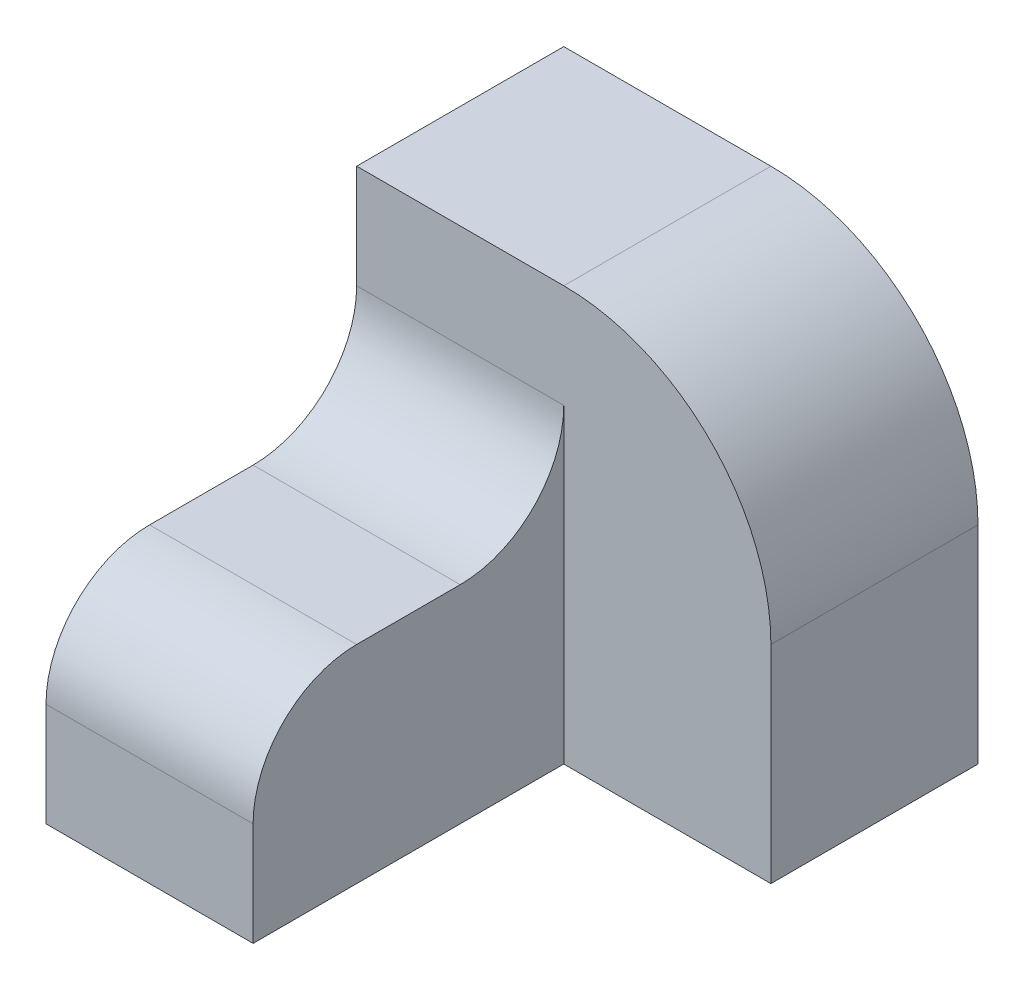
ISO-10303-21;
HEADER;
FILE_DESCRIPTION(('STEP AP214'),'2;1');
FILE_NAME('part.step','',(''),(''),'','','');
FILE_SCHEMA(('AUTOMOTIVE_DESIGN { 1 0 10303 214 1 1 1 1 }'));
ENDSEC;
DATA;
#1=APPLICATION_CONTEXT('core data for automotive mechanical design processes');
#2=APPLICATION_PROTOCOL_DEFINITION('international standard','automotive_design',2000,#1);
#3=PRODUCT_CONTEXT('',#1,'mechanical');
#4=PRODUCT('Part','Part','',(#3));
#5=PRODUCT_RELATED_PRODUCT_CATEGORY('part','',(#4));
#6=PRODUCT_DEFINITION_FORMATION('','',#4);
#7=PRODUCT_DEFINITION_CONTEXT('part definition',#1,'design');
#8=PRODUCT_DEFINITION('design','',#6,#7);
#9=PRODUCT_DEFINITION_SHAPE('','',#8);
#10=(LENGTH_UNIT() NAMED_UNIT(*) SI_UNIT(.MILLI.,.METRE.));
#11=(NAMED_UNIT(*) PLANE_ANGLE_UNIT() SI_UNIT($,.RADIAN.));
#12=(NAMED_UNIT(*) SI_UNIT($,.STERADIAN.) SOLID_ANGLE_UNIT());
#13=UNCERTAINTY_MEASURE_WITH_UNIT(LENGTH_MEASURE(1.E-05),#10,'distance_accuracy_value','');
#14=(GEOMETRIC_REPRESENTATION_CONTEXT(3) GLOBAL_UNCERTAINTY_ASSIGNED_CONTEXT((#13)) GLOBAL_UNIT_ASSIGNED_CONTEXT((#10,
#11,#12)) REPRESENTATION_CONTEXT('',''));
#15=CARTESIAN_POINT('',(0.,0.,0.));
#16=DIRECTION('',(0.,0.,1.));
#17=DIRECTION('',(1.,0.,0.));
#18=AXIS2_PLACEMENT_3D('',#15,#16,#17);
#19=CARTESIAN_POINT('',(8.61252963227666,8.63066834896516,-1.26566204034582));
#20=DIRECTION('',(1.,0.,0.));
#21=DIRECTION('',(0.,0.,-1.));
#22=AXIS2_PLACEMENT_3D('',#19,#20,#21);
#23=PLANE('',#22);
#24=DIRECTION('',(0.,0.,1.));
#25=VECTOR('',#24,1.);
#26=CARTESIAN_POINT('',(8.61252963227666,8.63066834896516,-1.26566204034582));
#27=LINE('',#26,#25);
#28=CARTESIAN_POINT('',(8.61252963227666,8.63066834896516,-0.265662040345824));
#29=VERTEX_POINT('',#28);
#30=CARTESIAN_POINT('',(8.61252963227666,8.63066834896516,0.734337959654176));
#31=VERTEX_POINT('',#30);
#32=EDGE_CURVE('E153',#29,#31,#27,.T.);
#33=ORIENTED_EDGE('',*,*,#32,.T.);
#34=CARTESIAN_POINT('',(8.61252963227666,7.63066834896515,0.734337959654176));
#35=DIRECTION('',(1.,0.,0.));
#36=DIRECTION('',(0.,0.,-1.));
#37=AXIS2_PLACEMENT_3D('',#34,#35,#36);
#38=CIRCLE('',#37,1.);
#39=CARTESIAN_POINT('',(8.61252963227666,7.63066834896515,1.73433795965418));
#40=VERTEX_POINT('',#39);
#41=EDGE_CURVE('E181',#31,#40,#38,.T.);
#42=ORIENTED_EDGE('',*,*,#41,.T.);
#43=DIRECTION('',(0.,-1.,0.));
#44=VECTOR('',#43,1.);
#45=CARTESIAN_POINT('',(8.61252963227666,8.63066834896516,1.73433795965418));
#46=LINE('',#45,#44);
#47=CARTESIAN_POINT('',(8.61252963227666,6.63066834896515,1.73433795965418));
#48=VERTEX_POINT('',#47);
#49=EDGE_CURVE('E160',#40,#48,#46,.T.);
#50=ORIENTED_EDGE('',*,*,#49,.T.);
#51=DIRECTION('',(0.,0.,1.));
#52=VECTOR('',#51,1.);
#53=CARTESIAN_POINT('',(8.61252963227666,6.63066834896515,-1.26566204034582));
#54=LINE('',#53,#52);
#55=CARTESIAN_POINT('',(8.61252963227666,6.63066834896515,-1.26566204034582));
#56=VERTEX_POINT('',#55);
#57=EDGE_CURVE('E152',#56,#48,#54,.T.);
#58=ORIENTED_EDGE('',*,*,#57,.F.);
#59=DIRECTION('',(0.,-1.,0.));
#60=VECTOR('',#59,1.);
#61=CARTESIAN_POINT('',(8.61252963227666,8.63066834896516,-1.26566204034582));
#62=LINE('',#61,#60);
#63=CARTESIAN_POINT('',(8.61252963227666,9.63066834896516,-1.26566204034582));
#64=VERTEX_POINT('',#63);
#65=EDGE_CURVE('E170',#64,#56,#62,.T.);
#66=ORIENTED_EDGE('',*,*,#65,.F.);
#67=CARTESIAN_POINT('',(8.61252963227666,9.63066834896516,-0.265662040345824));
#68=DIRECTION('',(1.,0.,0.));
#69=DIRECTION('',(0.,0.,-1.));
#70=AXIS2_PLACEMENT_3D('',#67,#68,#69);
#71=CIRCLE('',#70,1.);
#72=EDGE_CURVE('E187',#64,#29,#71,.F.);
#73=ORIENTED_EDGE('',*,*,#72,.T.);
#74=EDGE_LOOP('',(#33,#42,#50,#58,#66,#73));
#75=FACE_BOUND('',#74,.T.);
#76=ADVANCED_FACE('F38',(#75),#23,.T.);
#77=CARTESIAN_POINT('',(6.61252963227666,8.63066834896516,-1.26566204034582));
#78=DIRECTION('',(1.,0.,0.));
#79=DIRECTION('',(0.,0.,-1.));
#80=AXIS2_PLACEMENT_3D('',#77,#78,#79);
#81=PLANE('',#80);
#82=DIRECTION('',(0.,-1.,0.));
#83=VECTOR('',#82,1.);
#84=CARTESIAN_POINT('',(6.61252963227666,8.63066834896516,1.73433795965418));
#85=LINE('',#84,#83);
#86=CARTESIAN_POINT('',(6.61252963227666,7.63066834896515,1.73433795965418));
#87=VERTEX_POINT('',#86);
#88=CARTESIAN_POINT('',(6.61252963227666,6.63066834896515,1.73433795965418));
#89=VERTEX_POINT('',#88);
#90=EDGE_CURVE('E168',#87,#89,#85,.T.);
#91=ORIENTED_EDGE('',*,*,#90,.F.);
#92=CARTESIAN_POINT('',(6.61252963227666,7.63066834896515,0.734337959654176));
#93=DIRECTION('',(1.,0.,0.));
#94=DIRECTION('',(0.,0.,-1.));
#95=AXIS2_PLACEMENT_3D('',#92,#93,#94);
#96=CIRCLE('',#95,1.);
#97=CARTESIAN_POINT('',(6.61252963227666,8.63066834896516,0.734337959654176));
#98=VERTEX_POINT('',#97);
#99=EDGE_CURVE('E185',#87,#98,#96,.F.);
#100=ORIENTED_EDGE('',*,*,#99,.T.);
#101=DIRECTION('',(0.,0.,1.));
#102=VECTOR('',#101,1.);
#103=CARTESIAN_POINT('',(6.61252963227666,8.63066834896516,-1.26566204034582));
#104=LINE('',#103,#102);
#105=CARTESIAN_POINT('',(6.61252963227666,8.63066834896516,-0.265662040345824));
#106=VERTEX_POINT('',#105);
#107=EDGE_CURVE('E156',#106,#98,#104,.T.);
#108=ORIENTED_EDGE('',*,*,#107,.F.);
#109=CARTESIAN_POINT('',(6.61252963227666,9.63066834896516,-0.265662040345824));
#110=DIRECTION('',(1.,0.,0.));
#111=DIRECTION('',(0.,0.,-1.));
#112=AXIS2_PLACEMENT_3D('',#109,#110,#111);
#113=CIRCLE('',#112,1.);
#114=CARTESIAN_POINT('',(6.61252963227666,9.63066834896516,-1.26566204034582));
#115=VERTEX_POINT('',#114);
#116=EDGE_CURVE('E189',#106,#115,#113,.T.);
#117=ORIENTED_EDGE('',*,*,#116,.T.);
#118=DIRECTION('',(0.,-1.,0.));
#119=VECTOR('',#118,1.);
#120=CARTESIAN_POINT('',(6.61252963227666,10.6306683489652,-1.26566204034582));
#121=LINE('',#120,#119);
#122=CARTESIAN_POINT('',(6.61252963227666,10.6306683489652,-1.26566204034582));
#123=VERTEX_POINT('',#122);
#124=EDGE_CURVE('E122',#123,#115,#121,.T.);
#125=ORIENTED_EDGE('',*,*,#124,.F.);
#126=DIRECTION('',(0.,0.,-1.));
#127=VECTOR('',#126,1.);
#128=CARTESIAN_POINT('',(6.61252963227666,10.6306683489652,-1.26566204034582));
#129=LINE('',#128,#127);
#130=CARTESIAN_POINT('',(6.61252963227666,10.6306683489652,-3.26566204034582));
#131=VERTEX_POINT('',#130);
#132=EDGE_CURVE('E129',#123,#131,#129,.T.);
#133=ORIENTED_EDGE('',*,*,#132,.T.);
#134=DIRECTION('',(0.,-1.,0.));
#135=VECTOR('',#134,1.);
#136=CARTESIAN_POINT('',(6.61252963227666,10.6306683489652,-3.26566204034582));
#137=LINE('',#136,#135);
#138=CARTESIAN_POINT('',(6.61252963227666,6.63066834896515,-3.26566204034582));
#139=VERTEX_POINT('',#138);
#140=EDGE_CURVE('E112',#131,#139,#137,.T.);
#141=ORIENTED_EDGE('',*,*,#140,.T.);
#142=DIRECTION('',(0.,0.,1.));
#143=VECTOR('',#142,1.);
#144=CARTESIAN_POINT('',(6.61252963227666,6.63066834896515,-1.26566204034582));
#145=LINE('',#144,#143);
#146=EDGE_CURVE('E163',#139,#89,#145,.T.);
#147=ORIENTED_EDGE('',*,*,#146,.T.);
#148=EDGE_LOOP('',(#91,#100,#108,#117,#125,#133,#141,#147));
#149=FACE_BOUND('',#148,.T.);
#150=ADVANCED_FACE('F135',(#149),#81,.F.);
#151=CARTESIAN_POINT('',(6.61252963227666,8.63066834896516,1.73433795965418));
#152=DIRECTION('',(0.,0.,-1.));
#153=DIRECTION('',(-1.,0.,0.));
#154=AXIS2_PLACEMENT_3D('',#151,#152,#153);
#155=PLANE('',#154);
#156=ORIENTED_EDGE('',*,*,#49,.F.);
#157=DIRECTION('',(1.,0.,0.));
#158=VECTOR('',#157,1.);
#159=CARTESIAN_POINT('',(6.61252963227666,7.63066834896515,1.73433795965418));
#160=LINE('',#159,#158);
#161=EDGE_CURVE('E183',#40,#87,#160,.F.);
#162=ORIENTED_EDGE('',*,*,#161,.T.);
#163=ORIENTED_EDGE('',*,*,#90,.T.);
#164=DIRECTION('',(1.,0.,0.));
#165=VECTOR('',#164,1.);
#166=CARTESIAN_POINT('',(6.61252963227666,6.63066834896515,1.73433795965418));
#167=LINE('',#166,#165);
#168=EDGE_CURVE('E157',#89,#48,#167,.T.);
#169=ORIENTED_EDGE('',*,*,#168,.T.);
#170=EDGE_LOOP('',(#156,#162,#163,#169));
#171=FACE_BOUND('',#170,.T.);
#172=ADVANCED_FACE('F212',(#171),#155,.F.);
#173=CARTESIAN_POINT('',(6.61252963227666,8.63066834896516,-1.26566204034582));
#174=DIRECTION('',(0.,1.,0.));
#175=DIRECTION('',(0.,0.,1.));
#176=AXIS2_PLACEMENT_3D('',#173,#174,#175);
#177=PLANE('',#176);
#178=ORIENTED_EDGE('',*,*,#32,.F.);
#179=DIRECTION('',(1.,0.,0.));
#180=VECTOR('',#179,1.);
#181=CARTESIAN_POINT('',(6.61252963227666,8.63066834896516,-0.265662040345824));
#182=LINE('',#181,#180);
#183=EDGE_CURVE('E179',#29,#106,#182,.F.);
#184=ORIENTED_EDGE('',*,*,#183,.T.);
#185=ORIENTED_EDGE('',*,*,#107,.T.);
#186=DIRECTION('',(1.,0.,0.));
#187=VECTOR('',#186,1.);
#188=CARTESIAN_POINT('',(8.61252963227666,8.63066834896516,0.734337959654176));
#189=LINE('',#188,#187);
#190=EDGE_CURVE('E176',#98,#31,#189,.T.);
#191=ORIENTED_EDGE('',*,*,#190,.T.);
#192=EDGE_LOOP('',(#178,#184,#185,#191));
#193=FACE_BOUND('',#192,.T.);
#194=ADVANCED_FACE('F204',(#193),#177,.T.);
#195=CARTESIAN_POINT('',(6.61252963227666,6.63066834896515,-1.26566204034582));
#196=DIRECTION('',(0.,1.,0.));
#197=DIRECTION('',(0.,0.,1.));
#198=AXIS2_PLACEMENT_3D('',#195,#196,#197);
#199=PLANE('',#198);
#200=ORIENTED_EDGE('',*,*,#57,.T.);
#201=ORIENTED_EDGE('',*,*,#168,.F.);
#202=ORIENTED_EDGE('',*,*,#146,.F.);
#203=DIRECTION('',(1.,0.,0.));
#204=VECTOR('',#203,1.);
#205=CARTESIAN_POINT('',(6.61252963227666,6.63066834896515,-3.26566204034582));
#206=LINE('',#205,#204);
#207=CARTESIAN_POINT('',(10.6125296322767,6.63066834896515,-3.26566204034582));
#208=VERTEX_POINT('',#207);
#209=EDGE_CURVE('E117',#139,#208,#206,.T.);
#210=ORIENTED_EDGE('',*,*,#209,.T.);
#211=DIRECTION('',(0.,0.,-1.));
#212=VECTOR('',#211,1.);
#213=CARTESIAN_POINT('',(10.6125296322767,6.63066834896515,-1.26566204034582));
#214=LINE('',#213,#212);
#215=CARTESIAN_POINT('',(10.6125296322767,6.63066834896515,-1.26566204034582));
#216=VERTEX_POINT('',#215);
#217=EDGE_CURVE('E145',#216,#208,#214,.T.);
#218=ORIENTED_EDGE('',*,*,#217,.F.);
#219=DIRECTION('',(1.,0.,0.));
#220=VECTOR('',#219,1.);
#221=CARTESIAN_POINT('',(6.61252963227666,6.63066834896515,-1.26566204034582));
#222=LINE('',#221,#220);
#223=EDGE_CURVE('E142',#56,#216,#222,.T.);
#224=ORIENTED_EDGE('',*,*,#223,.F.);
#225=EDGE_LOOP('',(#200,#201,#202,#210,#218,#224));
#226=FACE_BOUND('',#225,.T.);
#227=ADVANCED_FACE('F216',(#226),#199,.F.);
#228=CARTESIAN_POINT('',(6.61252963227666,10.6306683489652,-1.26566204034582));
#229=DIRECTION('',(0.,0.,-1.));
#230=DIRECTION('',(-1.,0.,0.));
#231=AXIS2_PLACEMENT_3D('',#228,#229,#230);
#232=PLANE('',#231);
#233=DIRECTION('',(0.,-1.,0.));
#234=VECTOR('',#233,1.);
#235=CARTESIAN_POINT('',(10.6125296322767,10.6306683489652,-1.26566204034582));
#236=LINE('',#235,#234);
#237=CARTESIAN_POINT('',(10.6125296322767,8.63066834896516,-1.26566204034582));
#238=VERTEX_POINT('',#237);
#239=EDGE_CURVE('E150',#238,#216,#236,.T.);
#240=ORIENTED_EDGE('',*,*,#239,.F.);
#241=CARTESIAN_POINT('',(8.61252963227666,8.63066834896516,-1.26566204034582));
#242=DIRECTION('',(0.,0.,-1.));
#243=DIRECTION('',(-1.,0.,0.));
#244=AXIS2_PLACEMENT_3D('',#241,#242,#243);
#245=CIRCLE('',#244,2.);
#246=CARTESIAN_POINT('',(8.61252963227666,10.6306683489652,-1.26566204034582));
#247=VERTEX_POINT('',#246);
#248=EDGE_CURVE('E11',#238,#247,#245,.F.);
#249=ORIENTED_EDGE('',*,*,#248,.T.);
#250=DIRECTION('',(1.,0.,0.));
#251=VECTOR('',#250,1.);
#252=CARTESIAN_POINT('',(6.61252963227666,10.6306683489652,-1.26566204034582));
#253=LINE('',#252,#251);
#254=EDGE_CURVE('E132',#123,#247,#253,.T.);
#255=ORIENTED_EDGE('',*,*,#254,.F.);
#256=ORIENTED_EDGE('',*,*,#124,.T.);
#257=DIRECTION('',(1.,0.,0.));
#258=VECTOR('',#257,1.);
#259=CARTESIAN_POINT('',(6.61252963227666,9.63066834896516,-1.26566204034582));
#260=LINE('',#259,#258);
#261=EDGE_CURVE('E173',#115,#64,#260,.T.);
#262=ORIENTED_EDGE('',*,*,#261,.T.);
#263=ORIENTED_EDGE('',*,*,#65,.T.);
#264=ORIENTED_EDGE('',*,*,#223,.T.);
#265=EDGE_LOOP('',(#240,#249,#255,#256,#262,#263,#264));
#266=FACE_BOUND('',#265,.T.);
#267=ADVANCED_FACE('F198',(#266),#232,.F.);
#268=CARTESIAN_POINT('',(10.6125296322767,10.6306683489652,-1.26566204034582));
#269=DIRECTION('',(-1.,0.,0.));
#270=DIRECTION('',(0.,0.,1.));
#271=AXIS2_PLACEMENT_3D('',#268,#269,#270);
#272=PLANE('',#271);
#273=DIRECTION('',(0.,-1.,0.));
#274=VECTOR('',#273,1.);
#275=CARTESIAN_POINT('',(10.6125296322767,10.6306683489652,-3.26566204034582));
#276=LINE('',#275,#274);
#277=CARTESIAN_POINT('',(10.6125296322767,8.63066834896516,-3.26566204034582));
#278=VERTEX_POINT('',#277);
#279=EDGE_CURVE('E121',#278,#208,#276,.T.);
#280=ORIENTED_EDGE('',*,*,#279,.F.);
#281=DIRECTION('',(0.,0.,-1.));
#282=VECTOR('',#281,1.);
#283=CARTESIAN_POINT('',(10.6125296322767,8.63066834896516,-1.26566204034582));
#284=LINE('',#283,#282);
#285=EDGE_CURVE('E46',#278,#238,#284,.F.);
#286=ORIENTED_EDGE('',*,*,#285,.T.);
#287=ORIENTED_EDGE('',*,*,#239,.T.);
#288=ORIENTED_EDGE('',*,*,#217,.T.);
#289=EDGE_LOOP('',(#280,#286,#287,#288));
#290=FACE_BOUND('',#289,.T.);
#291=ADVANCED_FACE('F219',(#290),#272,.F.);
#292=CARTESIAN_POINT('',(6.61252963227666,10.6306683489652,-3.26566204034582));
#293=DIRECTION('',(0.,0.,-1.));
#294=DIRECTION('',(-1.,0.,0.));
#295=AXIS2_PLACEMENT_3D('',#292,#293,#294);
#296=PLANE('',#295);
#297=DIRECTION('',(1.,0.,0.));
#298=VECTOR('',#297,1.);
#299=CARTESIAN_POINT('',(6.61252963227666,10.6306683489652,-3.26566204034582));
#300=LINE('',#299,#298);
#301=CARTESIAN_POINT('',(8.61252963227666,10.6306683489652,-3.26566204034582));
#302=VERTEX_POINT('',#301);
#303=EDGE_CURVE('E115',#131,#302,#300,.T.);
#304=ORIENTED_EDGE('',*,*,#303,.T.);
#305=CARTESIAN_POINT('',(8.61252963227666,8.63066834896516,-3.26566204034582));
#306=DIRECTION('',(0.,0.,-1.));
#307=DIRECTION('',(-1.,0.,0.));
#308=AXIS2_PLACEMENT_3D('',#305,#306,#307);
#309=CIRCLE('',#308,2.);
#310=EDGE_CURVE('E60',#302,#278,#309,.T.);
#311=ORIENTED_EDGE('',*,*,#310,.T.);
#312=ORIENTED_EDGE('',*,*,#279,.T.);
#313=ORIENTED_EDGE('',*,*,#209,.F.);
#314=ORIENTED_EDGE('',*,*,#140,.F.);
#315=EDGE_LOOP('',(#304,#311,#312,#313,#314));
#316=FACE_BOUND('',#315,.T.);
#317=ADVANCED_FACE('F114',(#316),#296,.T.);
#318=CARTESIAN_POINT('',(6.61252963227666,10.6306683489652,-1.26566204034582));
#319=DIRECTION('',(0.,1.,0.));
#320=DIRECTION('',(0.,0.,1.));
#321=AXIS2_PLACEMENT_3D('',#318,#319,#320);
#322=PLANE('',#321);
#323=ORIENTED_EDGE('',*,*,#254,.T.);
#324=DIRECTION('',(0.,0.,-1.));
#325=VECTOR('',#324,1.);
#326=CARTESIAN_POINT('',(8.61252963227666,10.6306683489652,-3.26566204034582));
#327=LINE('',#326,#325);
#328=EDGE_CURVE('E131',#247,#302,#327,.T.);
#329=ORIENTED_EDGE('',*,*,#328,.T.);
#330=ORIENTED_EDGE('',*,*,#303,.F.);
#331=ORIENTED_EDGE('',*,*,#132,.F.);
#332=EDGE_LOOP('',(#323,#329,#330,#331));
#333=FACE_BOUND('',#332,.T.);
#334=ADVANCED_FACE('F128',(#333),#322,.T.);
#335=CARTESIAN_POINT('',(6.61252963227666,9.63066834896516,-0.265662040345824));
#336=DIRECTION('',(1.,0.,0.));
#337=DIRECTION('',(0.,0.,-1.));
#338=AXIS2_PLACEMENT_3D('',#335,#336,#337);
#339=CYLINDRICAL_SURFACE('',#338,1.);
#340=ORIENTED_EDGE('',*,*,#116,.F.);
#341=ORIENTED_EDGE('',*,*,#183,.F.);
#342=ORIENTED_EDGE('',*,*,#72,.F.);
#343=ORIENTED_EDGE('',*,*,#261,.F.);
#344=EDGE_LOOP('',(#340,#341,#342,#343));
#345=FACE_BOUND('',#344,.T.);
#346=ADVANCED_FACE('F200',(#345),#339,.F.);
#347=CARTESIAN_POINT('',(6.61252963227666,7.63066834896515,0.734337959654176));
#348=DIRECTION('',(-1.,0.,0.));
#349=DIRECTION('',(0.,0.,1.));
#350=AXIS2_PLACEMENT_3D('',#347,#348,#349);
#351=CYLINDRICAL_SURFACE('',#350,1.);
#352=ORIENTED_EDGE('',*,*,#99,.F.);
#353=ORIENTED_EDGE('',*,*,#161,.F.);
#354=ORIENTED_EDGE('',*,*,#41,.F.);
#355=ORIENTED_EDGE('',*,*,#190,.F.);
#356=EDGE_LOOP('',(#352,#353,#354,#355));
#357=FACE_BOUND('',#356,.T.);
#358=ADVANCED_FACE('F208',(#357),#351,.T.);
#359=CARTESIAN_POINT('',(8.61252963227666,8.63066834896516,-1.26566204034582));
#360=DIRECTION('',(0.,0.,1.));
#361=DIRECTION('',(1.,0.,0.));
#362=AXIS2_PLACEMENT_3D('',#359,#360,#361);
#363=CYLINDRICAL_SURFACE('',#362,2.);
#364=ORIENTED_EDGE('',*,*,#248,.F.);
#365=ORIENTED_EDGE('',*,*,#285,.F.);
#366=ORIENTED_EDGE('',*,*,#310,.F.);
#367=ORIENTED_EDGE('',*,*,#328,.F.);
#368=EDGE_LOOP('',(#364,#365,#366,#367));
#369=FACE_BOUND('',#368,.T.);
#370=ADVANCED_FACE('F40',(#369),#363,.T.);
#371=CLOSED_SHELL('',(#76,#150,#172,#194,#227,#267,#291,#317,#334,#346,#358,#370));
#372=MANIFOLD_SOLID_BREP('B2',#371);
#373=ADVANCED_BREP_SHAPE_REPRESENTATION('',(#18,#372),#14);
#374=SHAPE_DEFINITION_REPRESENTATION(#9,#373);
ENDSEC;
END-ISO-10303-21;
